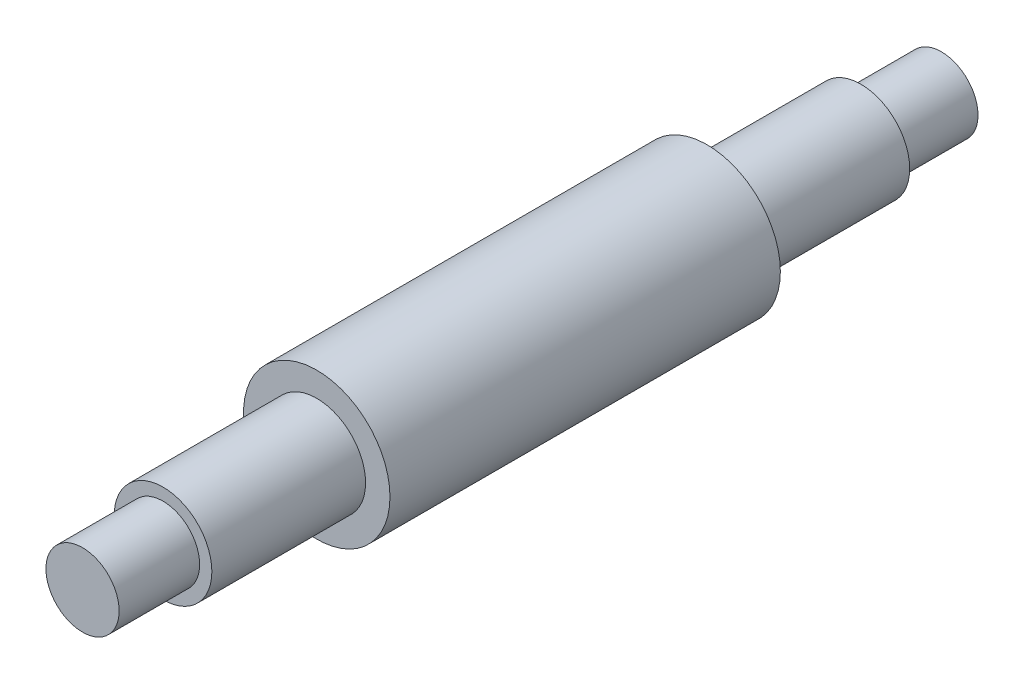
ISO-10303-21;
HEADER;
FILE_DESCRIPTION(('STEP AP214'),'2;1');
FILE_NAME('part.step','',(''),(''),'','','');
FILE_SCHEMA(('AUTOMOTIVE_DESIGN { 1 0 10303 214 1 1 1 1 }'));
ENDSEC;
DATA;
#1=APPLICATION_CONTEXT('core data for automotive mechanical design processes');
#2=APPLICATION_PROTOCOL_DEFINITION('international standard','automotive_design',2000,#1);
#3=PRODUCT_CONTEXT('',#1,'mechanical');
#4=PRODUCT('Part','Part','',(#3));
#5=PRODUCT_RELATED_PRODUCT_CATEGORY('part','',(#4));
#6=PRODUCT_DEFINITION_FORMATION('','',#4);
#7=PRODUCT_DEFINITION_CONTEXT('part definition',#1,'design');
#8=PRODUCT_DEFINITION('design','',#6,#7);
#9=PRODUCT_DEFINITION_SHAPE('','',#8);
#10=(LENGTH_UNIT() NAMED_UNIT(*) SI_UNIT(.MILLI.,.METRE.));
#11=(NAMED_UNIT(*) PLANE_ANGLE_UNIT() SI_UNIT($,.RADIAN.));
#12=(NAMED_UNIT(*) SI_UNIT($,.STERADIAN.) SOLID_ANGLE_UNIT());
#13=UNCERTAINTY_MEASURE_WITH_UNIT(LENGTH_MEASURE(1.E-05),#10,'distance_accuracy_value','');
#14=(GEOMETRIC_REPRESENTATION_CONTEXT(3) GLOBAL_UNCERTAINTY_ASSIGNED_CONTEXT((#13)) GLOBAL_UNIT_ASSIGNED_CONTEXT((#10,
#11,#12)) REPRESENTATION_CONTEXT('',''));
#15=CARTESIAN_POINT('',(0.,0.,0.));
#16=DIRECTION('',(0.,0.,1.));
#17=DIRECTION('',(1.,0.,0.));
#18=AXIS2_PLACEMENT_3D('',#15,#16,#17);
#19=CARTESIAN_POINT('',(0.,0.,-88.));
#20=DIRECTION('',(0.,0.,1.));
#21=DIRECTION('',(1.,0.,0.));
#22=AXIS2_PLACEMENT_3D('',#19,#20,#21);
#23=CYLINDRICAL_SURFACE('',#22,7.5);
#24=CARTESIAN_POINT('',(0.,0.,-88.));
#25=DIRECTION('',(0.,0.,1.));
#26=DIRECTION('',(1.,0.,0.));
#27=AXIS2_PLACEMENT_3D('',#24,#25,#26);
#28=CIRCLE('',#27,7.5);
#29=CARTESIAN_POINT('',(7.5,0.,-88.));
#30=VERTEX_POINT('',#29);
#31=EDGE_CURVE('E11',#30,#30,#28,.T.);
#32=ORIENTED_EDGE('',*,*,#31,.T.);
#33=EDGE_LOOP('',(#32));
#34=FACE_BOUND('',#33,.T.);
#35=CARTESIAN_POINT('',(0.,0.,-71.5));
#36=DIRECTION('',(0.,0.,1.));
#37=DIRECTION('',(1.,0.,0.));
#38=AXIS2_PLACEMENT_3D('',#35,#36,#37);
#39=CIRCLE('',#38,7.5);
#40=CARTESIAN_POINT('',(7.5,0.,-71.5));
#41=VERTEX_POINT('',#40);
#42=EDGE_CURVE('E50',#41,#41,#39,.T.);
#43=ORIENTED_EDGE('',*,*,#42,.F.);
#44=EDGE_LOOP('',(#43));
#45=FACE_BOUND('',#44,.T.);
#46=ADVANCED_FACE('F47',(#34,#45),#23,.T.);
#47=CARTESIAN_POINT('',(0.,0.,-88.));
#48=DIRECTION('',(0.,0.,1.));
#49=DIRECTION('',(1.,0.,0.));
#50=AXIS2_PLACEMENT_3D('',#47,#48,#49);
#51=PLANE('',#50);
#52=ORIENTED_EDGE('',*,*,#31,.F.);
#53=EDGE_LOOP('',(#52));
#54=FACE_BOUND('',#53,.T.);
#55=ADVANCED_FACE('F105',(#54),#51,.F.);
#56=CARTESIAN_POINT('',(0.,0.,-71.5));
#57=DIRECTION('',(0.,0.,1.));
#58=DIRECTION('',(1.,0.,0.));
#59=AXIS2_PLACEMENT_3D('',#56,#57,#58);
#60=CYLINDRICAL_SURFACE('',#59,10.);
#61=CARTESIAN_POINT('',(0.,0.,-71.5));
#62=DIRECTION('',(0.,0.,1.));
#63=DIRECTION('',(1.,0.,0.));
#64=AXIS2_PLACEMENT_3D('',#61,#62,#63);
#65=CIRCLE('',#64,10.);
#66=CARTESIAN_POINT('',(10.,0.,-71.5));
#67=VERTEX_POINT('',#66);
#68=EDGE_CURVE('E57',#67,#67,#65,.T.);
#69=ORIENTED_EDGE('',*,*,#68,.T.);
#70=EDGE_LOOP('',(#69));
#71=FACE_BOUND('',#70,.T.);
#72=CARTESIAN_POINT('',(0.,0.,-40.));
#73=DIRECTION('',(0.,0.,1.));
#74=DIRECTION('',(1.,0.,0.));
#75=AXIS2_PLACEMENT_3D('',#72,#73,#74);
#76=CIRCLE('',#75,10.);
#77=CARTESIAN_POINT('',(10.,0.,-40.));
#78=VERTEX_POINT('',#77);
#79=EDGE_CURVE('E59',#78,#78,#76,.T.);
#80=ORIENTED_EDGE('',*,*,#79,.F.);
#81=EDGE_LOOP('',(#80));
#82=FACE_BOUND('',#81,.T.);
#83=ADVANCED_FACE('F109',(#71,#82),#60,.T.);
#84=CARTESIAN_POINT('',(0.,0.,-71.5));
#85=DIRECTION('',(0.,0.,1.));
#86=DIRECTION('',(1.,0.,0.));
#87=AXIS2_PLACEMENT_3D('',#84,#85,#86);
#88=PLANE('',#87);
#89=ORIENTED_EDGE('',*,*,#42,.T.);
#90=EDGE_LOOP('',(#89));
#91=FACE_BOUND('',#90,.T.);
#92=ORIENTED_EDGE('',*,*,#68,.F.);
#93=EDGE_LOOP('',(#92));
#94=FACE_BOUND('',#93,.T.);
#95=ADVANCED_FACE('F95',(#91,#94),#88,.F.);
#96=CARTESIAN_POINT('',(0.,0.,40.));
#97=DIRECTION('',(0.,0.,-1.));
#98=DIRECTION('',(-1.,0.,0.));
#99=AXIS2_PLACEMENT_3D('',#96,#97,#98);
#100=CYLINDRICAL_SURFACE('',#99,15.);
#101=CARTESIAN_POINT('',(0.,0.,40.));
#102=DIRECTION('',(0.,0.,1.));
#103=DIRECTION('',(1.,0.,0.));
#104=AXIS2_PLACEMENT_3D('',#101,#102,#103);
#105=CIRCLE('',#104,15.);
#106=CARTESIAN_POINT('',(15.,0.,40.));
#107=VERTEX_POINT('',#106);
#108=EDGE_CURVE('E68',#107,#107,#105,.T.);
#109=ORIENTED_EDGE('',*,*,#108,.F.);
#110=EDGE_LOOP('',(#109));
#111=FACE_BOUND('',#110,.T.);
#112=CARTESIAN_POINT('',(0.,0.,-40.));
#113=DIRECTION('',(0.,0.,1.));
#114=DIRECTION('',(1.,0.,0.));
#115=AXIS2_PLACEMENT_3D('',#112,#113,#114);
#116=CIRCLE('',#115,15.);
#117=CARTESIAN_POINT('',(15.,0.,-40.));
#118=VERTEX_POINT('',#117);
#119=EDGE_CURVE('E65',#118,#118,#116,.T.);
#120=ORIENTED_EDGE('',*,*,#119,.T.);
#121=EDGE_LOOP('',(#120));
#122=FACE_BOUND('',#121,.T.);
#123=ADVANCED_FACE('F89',(#111,#122),#100,.T.);
#124=CARTESIAN_POINT('',(0.,0.,40.));
#125=DIRECTION('',(0.,0.,1.));
#126=DIRECTION('',(1.,0.,0.));
#127=AXIS2_PLACEMENT_3D('',#124,#125,#126);
#128=PLANE('',#127);
#129=CARTESIAN_POINT('',(0.,0.,40.));
#130=DIRECTION('',(0.,0.,1.));
#131=DIRECTION('',(1.,0.,0.));
#132=AXIS2_PLACEMENT_3D('',#129,#130,#131);
#133=CIRCLE('',#132,10.);
#134=CARTESIAN_POINT('',(10.,0.,40.));
#135=VERTEX_POINT('',#134);
#136=EDGE_CURVE('E62',#135,#135,#133,.T.);
#137=ORIENTED_EDGE('',*,*,#136,.F.);
#138=EDGE_LOOP('',(#137));
#139=FACE_BOUND('',#138,.T.);
#140=ORIENTED_EDGE('',*,*,#108,.T.);
#141=EDGE_LOOP('',(#140));
#142=FACE_BOUND('',#141,.T.);
#143=ADVANCED_FACE('F86',(#139,#142),#128,.T.);
#144=CARTESIAN_POINT('',(0.,0.,-40.));
#145=DIRECTION('',(0.,0.,1.));
#146=DIRECTION('',(1.,0.,0.));
#147=AXIS2_PLACEMENT_3D('',#144,#145,#146);
#148=PLANE('',#147);
#149=ORIENTED_EDGE('',*,*,#79,.T.);
#150=EDGE_LOOP('',(#149));
#151=FACE_BOUND('',#150,.T.);
#152=ORIENTED_EDGE('',*,*,#119,.F.);
#153=EDGE_LOOP('',(#152));
#154=FACE_BOUND('',#153,.T.);
#155=ADVANCED_FACE('F82',(#151,#154),#148,.F.);
#156=CARTESIAN_POINT('',(0.,0.,71.5));
#157=DIRECTION('',(0.,0.,-1.));
#158=DIRECTION('',(-1.,0.,0.));
#159=AXIS2_PLACEMENT_3D('',#156,#157,#158);
#160=CYLINDRICAL_SURFACE('',#159,10.);
#161=CARTESIAN_POINT('',(0.,0.,71.5));
#162=DIRECTION('',(0.,0.,1.));
#163=DIRECTION('',(1.,0.,0.));
#164=AXIS2_PLACEMENT_3D('',#161,#162,#163);
#165=CIRCLE('',#164,10.);
#166=CARTESIAN_POINT('',(10.,0.,71.5));
#167=VERTEX_POINT('',#166);
#168=EDGE_CURVE('E69',#167,#167,#165,.T.);
#169=ORIENTED_EDGE('',*,*,#168,.F.);
#170=EDGE_LOOP('',(#169));
#171=FACE_BOUND('',#170,.T.);
#172=ORIENTED_EDGE('',*,*,#136,.T.);
#173=EDGE_LOOP('',(#172));
#174=FACE_BOUND('',#173,.T.);
#175=ADVANCED_FACE('F79',(#171,#174),#160,.T.);
#176=CARTESIAN_POINT('',(0.,0.,71.5));
#177=DIRECTION('',(0.,0.,1.));
#178=DIRECTION('',(1.,0.,0.));
#179=AXIS2_PLACEMENT_3D('',#176,#177,#178);
#180=PLANE('',#179);
#181=ORIENTED_EDGE('',*,*,#168,.T.);
#182=EDGE_LOOP('',(#181));
#183=FACE_BOUND('',#182,.T.);
#184=ADVANCED_FACE('F77',(#183),#180,.T.);
#185=CLOSED_SHELL('',(#46,#55,#83,#95,#123,#143,#155,#175,#184));
#186=MANIFOLD_SOLID_BREP('B2',#185);
#187=CARTESIAN_POINT('',(0.,0.,88.));
#188=DIRECTION('',(0.,0.,-1.));
#189=DIRECTION('',(-1.,0.,0.));
#190=AXIS2_PLACEMENT_3D('',#187,#188,#189);
#191=CYLINDRICAL_SURFACE('',#190,7.5);
#192=CARTESIAN_POINT('',(0.,0.,88.));
#193=DIRECTION('',(0.,0.,1.));
#194=DIRECTION('',(1.,0.,0.));
#195=AXIS2_PLACEMENT_3D('',#192,#193,#194);
#196=CIRCLE('',#195,7.5);
#197=CARTESIAN_POINT('',(7.5,0.,88.));
#198=VERTEX_POINT('',#197);
#199=EDGE_CURVE('E46',#198,#198,#196,.T.);
#200=ORIENTED_EDGE('',*,*,#199,.F.);
#201=EDGE_LOOP('',(#200));
#202=FACE_BOUND('',#201,.T.);
#203=CARTESIAN_POINT('',(0.,0.,71.5));
#204=DIRECTION('',(0.,0.,1.));
#205=DIRECTION('',(1.,0.,0.));
#206=AXIS2_PLACEMENT_3D('',#203,#204,#205);
#207=CIRCLE('',#206,7.5);
#208=CARTESIAN_POINT('',(7.5,0.,71.5));
#209=VERTEX_POINT('',#208);
#210=EDGE_CURVE('E199',#209,#209,#207,.T.);
#211=ORIENTED_EDGE('',*,*,#210,.T.);
#212=EDGE_LOOP('',(#211));
#213=FACE_BOUND('',#212,.T.);
#214=ADVANCED_FACE('F196',(#202,#213),#191,.T.);
#215=CARTESIAN_POINT('',(0.,0.,88.));
#216=DIRECTION('',(0.,0.,1.));
#217=DIRECTION('',(1.,0.,0.));
#218=AXIS2_PLACEMENT_3D('',#215,#216,#217);
#219=PLANE('',#218);
#220=ORIENTED_EDGE('',*,*,#199,.T.);
#221=EDGE_LOOP('',(#220));
#222=FACE_BOUND('',#221,.T.);
#223=ADVANCED_FACE('F211',(#222),#219,.T.);
#224=CARTESIAN_POINT('',(0.,0.,71.5));
#225=DIRECTION('',(0.,0.,1.));
#226=DIRECTION('',(1.,0.,0.));
#227=AXIS2_PLACEMENT_3D('',#224,#225,#226);
#228=PLANE('',#227);
#229=ORIENTED_EDGE('',*,*,#210,.F.);
#230=EDGE_LOOP('',(#229));
#231=FACE_BOUND('',#230,.T.);
#232=ADVANCED_FACE('F209',(#231),#228,.F.);
#233=CLOSED_SHELL('',(#214,#223,#232));
#234=MANIFOLD_SOLID_BREP('B6',#233);
#235=ADVANCED_BREP_SHAPE_REPRESENTATION('',(#18,#186,#234),#14);
#236=SHAPE_DEFINITION_REPRESENTATION(#9,#235);
ENDSEC;
END-ISO-10303-21;
